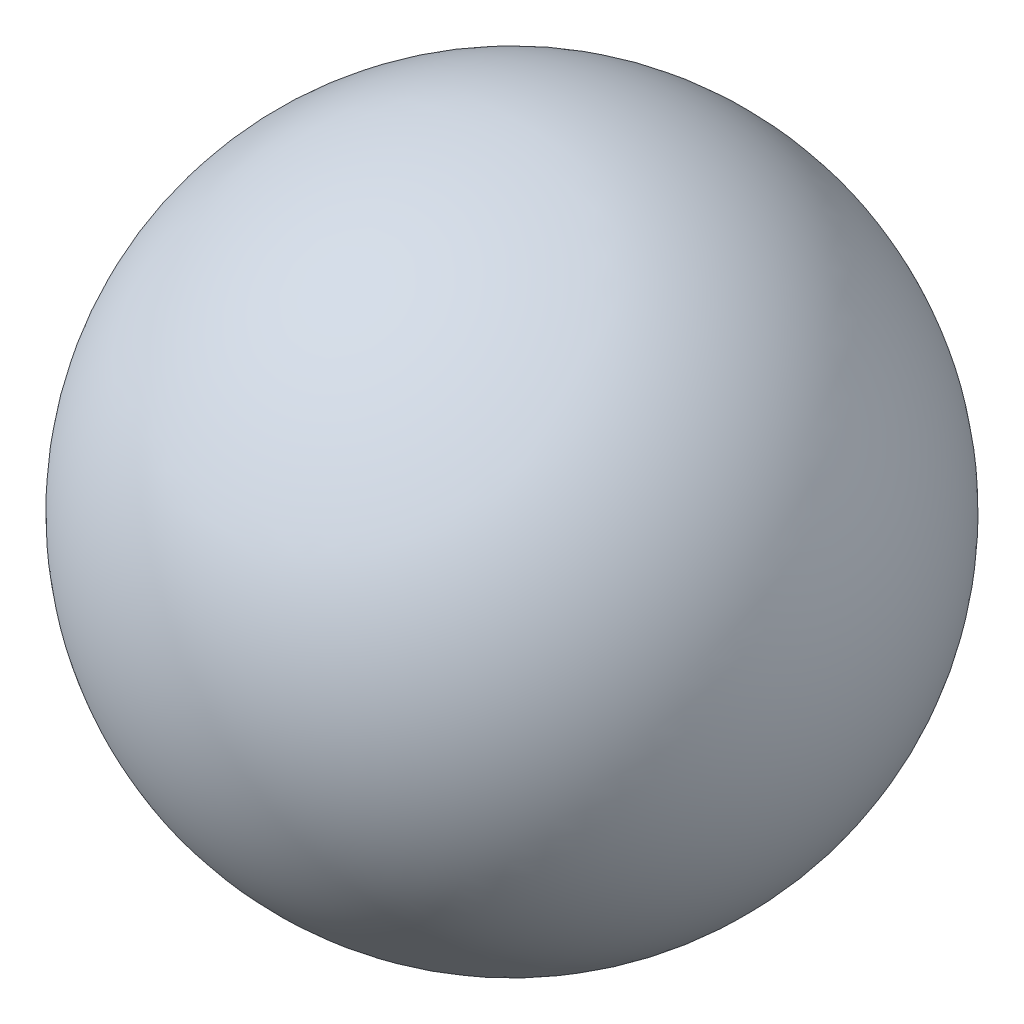
ISO-10303-21;
HEADER;
FILE_DESCRIPTION(('STEP AP214'),'2;1');
FILE_NAME('part.step','',(''),(''),'','','');
FILE_SCHEMA(('AUTOMOTIVE_DESIGN { 1 0 10303 214 1 1 1 1 }'));
ENDSEC;
DATA;
#1=APPLICATION_CONTEXT('core data for automotive mechanical design processes');
#2=APPLICATION_PROTOCOL_DEFINITION('international standard','automotive_design',2000,#1);
#3=PRODUCT_CONTEXT('',#1,'mechanical');
#4=PRODUCT('Part','Part','',(#3));
#5=PRODUCT_RELATED_PRODUCT_CATEGORY('part','',(#4));
#6=PRODUCT_DEFINITION_FORMATION('','',#4);
#7=PRODUCT_DEFINITION_CONTEXT('part definition',#1,'design');
#8=PRODUCT_DEFINITION('design','',#6,#7);
#9=PRODUCT_DEFINITION_SHAPE('','',#8);
#10=(LENGTH_UNIT() NAMED_UNIT(*) SI_UNIT(.MILLI.,.METRE.));
#11=(NAMED_UNIT(*) PLANE_ANGLE_UNIT() SI_UNIT($,.RADIAN.));
#12=(NAMED_UNIT(*) SI_UNIT($,.STERADIAN.) SOLID_ANGLE_UNIT());
#13=UNCERTAINTY_MEASURE_WITH_UNIT(LENGTH_MEASURE(1.E-05),#10,'distance_accuracy_value','');
#14=(GEOMETRIC_REPRESENTATION_CONTEXT(3) GLOBAL_UNCERTAINTY_ASSIGNED_CONTEXT((#13)) GLOBAL_UNIT_ASSIGNED_CONTEXT((#10,
#11,#12)) REPRESENTATION_CONTEXT('',''));
#15=CARTESIAN_POINT('',(0.,0.,0.));
#16=DIRECTION('',(0.,0.,1.));
#17=DIRECTION('',(1.,0.,0.));
#18=AXIS2_PLACEMENT_3D('',#15,#16,#17);
#19=CARTESIAN_POINT('',(0.,0.,0.));
#20=DIRECTION('',(0.,0.,-1.));
#21=DIRECTION('',(1.,0.,0.));
#22=AXIS2_PLACEMENT_3D('',#19,#20,#21);
#23=SPHERICAL_SURFACE('',#22,2.25);
#24=CARTESIAN_POINT('',(0.,0.,-2.25));
#25=VERTEX_POINT('',#24);
#26=VERTEX_LOOP('',#25);
#27=FACE_BOUND('',#26,.T.);
#28=ADVANCED_FACE('F30',(#27),#23,.T.);
#29=CLOSED_SHELL('',(#28));
#30=MANIFOLD_SOLID_BREP('B2',#29);
#31=ADVANCED_BREP_SHAPE_REPRESENTATION('',(#18,#30),#14);
#32=SHAPE_DEFINITION_REPRESENTATION(#9,#31);
ENDSEC;
END-ISO-10303-21;
